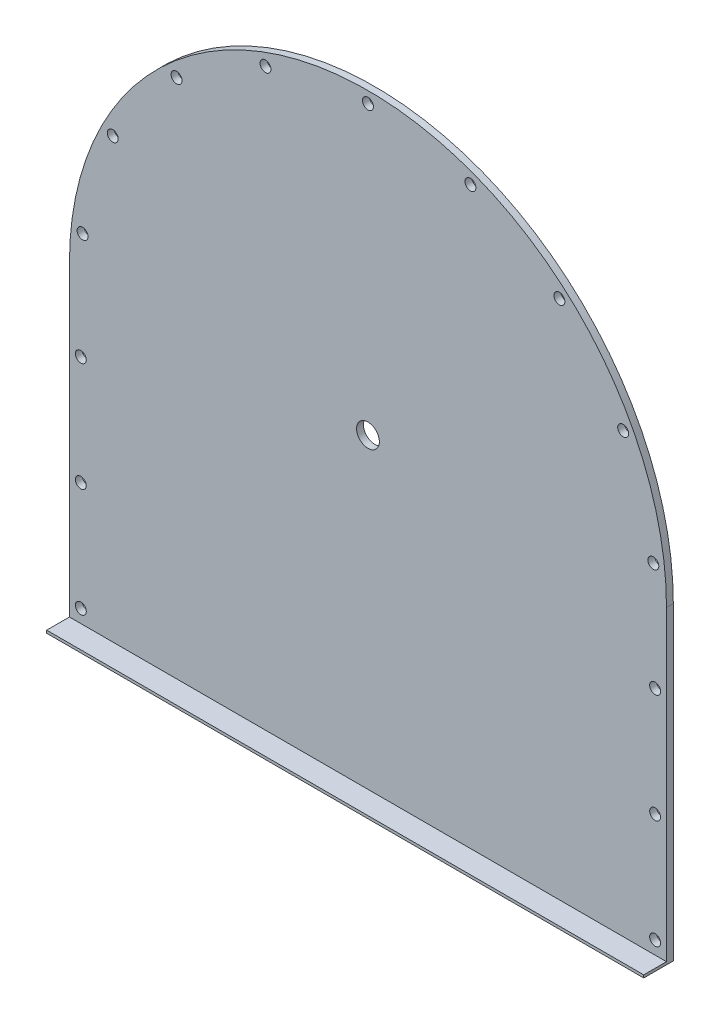
ISO-10303-21;
HEADER;
FILE_DESCRIPTION(('STEP AP214'),'2;1');
FILE_NAME('part.step','',(''),(''),'','','');
FILE_SCHEMA(('AUTOMOTIVE_DESIGN { 1 0 10303 214 1 1 1 1 }'));
ENDSEC;
DATA;
#1=APPLICATION_CONTEXT('core data for automotive mechanical design processes');
#2=APPLICATION_PROTOCOL_DEFINITION('international standard','automotive_design',2000,#1);
#3=PRODUCT_CONTEXT('',#1,'mechanical');
#4=PRODUCT('Part','Part','',(#3));
#5=PRODUCT_RELATED_PRODUCT_CATEGORY('part','',(#4));
#6=PRODUCT_DEFINITION_FORMATION('','',#4);
#7=PRODUCT_DEFINITION_CONTEXT('part definition',#1,'design');
#8=PRODUCT_DEFINITION('design','',#6,#7);
#9=PRODUCT_DEFINITION_SHAPE('','',#8);
#10=(LENGTH_UNIT() NAMED_UNIT(*) SI_UNIT(.MILLI.,.METRE.));
#11=(NAMED_UNIT(*) PLANE_ANGLE_UNIT() SI_UNIT($,.RADIAN.));
#12=(NAMED_UNIT(*) SI_UNIT($,.STERADIAN.) SOLID_ANGLE_UNIT());
#13=UNCERTAINTY_MEASURE_WITH_UNIT(LENGTH_MEASURE(1.E-05),#10,'distance_accuracy_value','');
#14=(GEOMETRIC_REPRESENTATION_CONTEXT(3) GLOBAL_UNCERTAINTY_ASSIGNED_CONTEXT((#13)) GLOBAL_UNIT_ASSIGNED_CONTEXT((#10,
#11,#12)) REPRESENTATION_CONTEXT('',''));
#15=CARTESIAN_POINT('',(0.,0.,0.));
#16=DIRECTION('',(0.,0.,1.));
#17=DIRECTION('',(1.,0.,0.));
#18=AXIS2_PLACEMENT_3D('',#15,#16,#17);
#19=CARTESIAN_POINT('',(0.,680.,15.));
#20=DIRECTION('',(0.,0.,1.));
#21=DIRECTION('',(1.,0.,0.));
#22=AXIS2_PLACEMENT_3D('',#19,#20,#21);
#23=PLANE('',#22);
#24=CARTESIAN_POINT('',(0.,680.,15.));
#25=DIRECTION('',(0.,0.,1.));
#26=DIRECTION('',(1.,0.,0.));
#27=AXIS2_PLACEMENT_3D('',#24,#25,#26);
#28=CIRCLE('',#27,25.);
#29=CARTESIAN_POINT('',(25.,680.,15.));
#30=VERTEX_POINT('',#29);
#31=EDGE_CURVE('E262',#30,#30,#28,.T.);
#32=ORIENTED_EDGE('',*,*,#31,.F.);
#33=EDGE_LOOP('',(#32));
#34=FACE_BOUND('',#33,.T.);
#35=CARTESIAN_POINT('',(-631.,274.348912911065,15.));
#36=DIRECTION('',(0.,0.,1.));
#37=DIRECTION('',(1.,0.,0.));
#38=AXIS2_PLACEMENT_3D('',#35,#36,#37);
#39=CIRCLE('',#38,12.);
#40=CARTESIAN_POINT('',(-619.,274.348912911065,15.));
#41=VERTEX_POINT('',#40);
#42=EDGE_CURVE('E239',#41,#41,#39,.F.);
#43=ORIENTED_EDGE('',*,*,#42,.T.);
#44=EDGE_LOOP('',(#43));
#45=FACE_BOUND('',#44,.T.);
#46=CARTESIAN_POINT('',(-627.092089955321,750.117834503557,15.));
#47=DIRECTION('',(0.,0.,1.));
#48=DIRECTION('',(1.,0.,0.));
#49=AXIS2_PLACEMENT_3D('',#46,#47,#48);
#50=CIRCLE('',#49,12.);
#51=CARTESIAN_POINT('',(-615.092089955321,750.117834503557,15.));
#52=VERTEX_POINT('',#51);
#53=EDGE_CURVE('E245',#52,#52,#50,.F.);
#54=ORIENTED_EDGE('',*,*,#53,.T.);
#55=EDGE_LOOP('',(#54));
#56=FACE_BOUND('',#55,.T.);
#57=CARTESIAN_POINT('',(-420.664145386944,1150.32188635643,15.));
#58=DIRECTION('',(0.,0.,1.));
#59=DIRECTION('',(1.,0.,0.));
#60=AXIS2_PLACEMENT_3D('',#57,#58,#59);
#61=CIRCLE('',#60,12.);
#62=CARTESIAN_POINT('',(-408.664145386944,1150.32188635643,15.));
#63=VERTEX_POINT('',#62);
#64=EDGE_CURVE('E251',#63,#63,#61,.F.);
#65=ORIENTED_EDGE('',*,*,#64,.T.);
#66=EDGE_LOOP('',(#65));
#67=FACE_BOUND('',#66,.T.);
#68=CARTESIAN_POINT('',(631.,35.,15.));
#69=DIRECTION('',(0.,0.,1.));
#70=DIRECTION('',(1.,0.,0.));
#71=AXIS2_PLACEMENT_3D('',#68,#69,#70);
#72=CIRCLE('',#71,12.);
#73=CARTESIAN_POINT('',(643.,35.,15.));
#74=VERTEX_POINT('',#73);
#75=EDGE_CURVE('E174',#74,#74,#72,.T.);
#76=ORIENTED_EDGE('',*,*,#75,.F.);
#77=EDGE_LOOP('',(#76));
#78=FACE_BOUND('',#77,.T.);
#79=CARTESIAN_POINT('',(0.,1311.,15.));
#80=DIRECTION('',(0.,0.,1.));
#81=DIRECTION('',(1.,0.,0.));
#82=AXIS2_PLACEMENT_3D('',#79,#80,#81);
#83=CIRCLE('',#82,12.);
#84=CARTESIAN_POINT('',(12.,1311.,15.));
#85=VERTEX_POINT('',#84);
#86=EDGE_CURVE('E212',#85,#85,#83,.T.);
#87=ORIENTED_EDGE('',*,*,#86,.F.);
#88=EDGE_LOOP('',(#87));
#89=FACE_BOUND('',#88,.T.);
#90=CARTESIAN_POINT('',(225.153158659935,1269.46336200434,15.));
#91=DIRECTION('',(0.,0.,1.));
#92=DIRECTION('',(1.,0.,0.));
#93=AXIS2_PLACEMENT_3D('',#90,#91,#92);
#94=CIRCLE('',#93,12.);
#95=CARTESIAN_POINT('',(237.153158659935,1269.46336200434,15.));
#96=VERTEX_POINT('',#95);
#97=EDGE_CURVE('E209',#96,#96,#94,.T.);
#98=ORIENTED_EDGE('',*,*,#97,.F.);
#99=EDGE_LOOP('',(#98));
#100=FACE_BOUND('',#99,.T.);
#101=CARTESIAN_POINT('',(420.664145386944,1150.32188635643,15.));
#102=DIRECTION('',(0.,0.,1.));
#103=DIRECTION('',(1.,0.,0.));
#104=AXIS2_PLACEMENT_3D('',#101,#102,#103);
#105=CIRCLE('',#104,12.);
#106=CARTESIAN_POINT('',(432.664145386944,1150.32188635643,15.));
#107=VERTEX_POINT('',#106);
#108=EDGE_CURVE('E206',#107,#107,#105,.T.);
#109=ORIENTED_EDGE('',*,*,#108,.F.);
#110=EDGE_LOOP('',(#109));
#111=FACE_BOUND('',#110,.T.);
#112=CARTESIAN_POINT('',(560.793280054704,969.260949741728,15.));
#113=DIRECTION('',(0.,0.,1.));
#114=DIRECTION('',(1.,0.,0.));
#115=AXIS2_PLACEMENT_3D('',#112,#113,#114);
#116=CIRCLE('',#115,12.);
#117=CARTESIAN_POINT('',(572.793280054704,969.260949741728,15.));
#118=VERTEX_POINT('',#117);
#119=EDGE_CURVE('E203',#118,#118,#116,.T.);
#120=ORIENTED_EDGE('',*,*,#119,.F.);
#121=EDGE_LOOP('',(#120));
#122=FACE_BOUND('',#121,.T.);
#123=CARTESIAN_POINT('',(627.092089955321,750.117834503557,15.));
#124=DIRECTION('',(0.,0.,1.));
#125=DIRECTION('',(1.,0.,0.));
#126=AXIS2_PLACEMENT_3D('',#123,#124,#125);
#127=CIRCLE('',#126,12.);
#128=CARTESIAN_POINT('',(639.092089955321,750.117834503557,15.));
#129=VERTEX_POINT('',#128);
#130=EDGE_CURVE('E200',#129,#129,#127,.T.);
#131=ORIENTED_EDGE('',*,*,#130,.F.);
#132=EDGE_LOOP('',(#131));
#133=FACE_BOUND('',#132,.T.);
#134=CARTESIAN_POINT('',(631.,513.697825822129,15.));
#135=DIRECTION('',(0.,0.,1.));
#136=DIRECTION('',(1.,0.,0.));
#137=AXIS2_PLACEMENT_3D('',#134,#135,#136);
#138=CIRCLE('',#137,12.);
#139=CARTESIAN_POINT('',(643.,513.697825822129,15.));
#140=VERTEX_POINT('',#139);
#141=EDGE_CURVE('E197',#140,#140,#138,.T.);
#142=ORIENTED_EDGE('',*,*,#141,.F.);
#143=EDGE_LOOP('',(#142));
#144=FACE_BOUND('',#143,.T.);
#145=CARTESIAN_POINT('',(631.,274.348912911065,15.));
#146=DIRECTION('',(0.,0.,1.));
#147=DIRECTION('',(1.,0.,0.));
#148=AXIS2_PLACEMENT_3D('',#145,#146,#147);
#149=CIRCLE('',#148,12.);
#150=CARTESIAN_POINT('',(643.,274.348912911065,15.));
#151=VERTEX_POINT('',#150);
#152=EDGE_CURVE('E194',#151,#151,#149,.T.);
#153=ORIENTED_EDGE('',*,*,#152,.F.);
#154=EDGE_LOOP('',(#153));
#155=FACE_BOUND('',#154,.T.);
#156=CARTESIAN_POINT('',(-225.153158659935,1269.46336200434,15.));
#157=DIRECTION('',(0.,0.,1.));
#158=DIRECTION('',(1.,0.,0.));
#159=AXIS2_PLACEMENT_3D('',#156,#157,#158);
#160=CIRCLE('',#159,12.);
#161=CARTESIAN_POINT('',(-213.153158659935,1269.46336200434,15.));
#162=VERTEX_POINT('',#161);
#163=EDGE_CURVE('E254',#162,#162,#160,.F.);
#164=ORIENTED_EDGE('',*,*,#163,.T.);
#165=EDGE_LOOP('',(#164));
#166=FACE_BOUND('',#165,.T.);
#167=CARTESIAN_POINT('',(-560.793280054704,969.260949741728,15.));
#168=DIRECTION('',(0.,0.,1.));
#169=DIRECTION('',(1.,0.,0.));
#170=AXIS2_PLACEMENT_3D('',#167,#168,#169);
#171=CIRCLE('',#170,12.);
#172=CARTESIAN_POINT('',(-548.793280054704,969.260949741728,15.));
#173=VERTEX_POINT('',#172);
#174=EDGE_CURVE('E248',#173,#173,#171,.F.);
#175=ORIENTED_EDGE('',*,*,#174,.T.);
#176=EDGE_LOOP('',(#175));
#177=FACE_BOUND('',#176,.T.);
#178=CARTESIAN_POINT('',(-631.,513.697825822129,15.));
#179=DIRECTION('',(0.,0.,1.));
#180=DIRECTION('',(1.,0.,0.));
#181=AXIS2_PLACEMENT_3D('',#178,#179,#180);
#182=CIRCLE('',#181,12.);
#183=CARTESIAN_POINT('',(-619.,513.697825822129,15.));
#184=VERTEX_POINT('',#183);
#185=EDGE_CURVE('E242',#184,#184,#182,.F.);
#186=ORIENTED_EDGE('',*,*,#185,.T.);
#187=EDGE_LOOP('',(#186));
#188=FACE_BOUND('',#187,.T.);
#189=CARTESIAN_POINT('',(-631.,35.,15.));
#190=DIRECTION('',(0.,0.,1.));
#191=DIRECTION('',(1.,0.,0.));
#192=AXIS2_PLACEMENT_3D('',#189,#190,#191);
#193=CIRCLE('',#192,12.);
#194=CARTESIAN_POINT('',(-619.,35.,15.));
#195=VERTEX_POINT('',#194);
#196=EDGE_CURVE('E220',#195,#195,#193,.F.);
#197=ORIENTED_EDGE('',*,*,#196,.T.);
#198=EDGE_LOOP('',(#197));
#199=FACE_BOUND('',#198,.T.);
#200=DIRECTION('',(0.,1.,0.));
#201=VECTOR('',#200,1.);
#202=CARTESIAN_POINT('',(-656.,0.,15.));
#203=LINE('',#202,#201);
#204=CARTESIAN_POINT('',(-656.,6.,15.));
#205=VERTEX_POINT('',#204);
#206=CARTESIAN_POINT('',(-656.,680.,15.));
#207=VERTEX_POINT('',#206);
#208=EDGE_CURVE('E169',#205,#207,#203,.T.);
#209=ORIENTED_EDGE('',*,*,#208,.F.);
#210=DIRECTION('',(1.,0.,0.));
#211=VECTOR('',#210,1.);
#212=CARTESIAN_POINT('',(-656.,6.,15.));
#213=LINE('',#212,#211);
#214=CARTESIAN_POINT('',(656.,6.,15.));
#215=VERTEX_POINT('',#214);
#216=EDGE_CURVE('E289',#205,#215,#213,.T.);
#217=ORIENTED_EDGE('',*,*,#216,.T.);
#218=DIRECTION('',(0.,1.,0.));
#219=VECTOR('',#218,1.);
#220=CARTESIAN_POINT('',(656.,0.,15.));
#221=LINE('',#220,#219);
#222=CARTESIAN_POINT('',(656.,680.,15.));
#223=VERTEX_POINT('',#222);
#224=EDGE_CURVE('E130',#215,#223,#221,.T.);
#225=ORIENTED_EDGE('',*,*,#224,.T.);
#226=CARTESIAN_POINT('',(0.,680.,15.));
#227=DIRECTION('',(0.,0.,1.));
#228=DIRECTION('',(1.,0.,0.));
#229=AXIS2_PLACEMENT_3D('',#226,#227,#228);
#230=CIRCLE('',#229,656.);
#231=EDGE_CURVE('E188',#223,#207,#230,.T.);
#232=ORIENTED_EDGE('',*,*,#231,.T.);
#233=EDGE_LOOP('',(#209,#217,#225,#232));
#234=FACE_BOUND('',#233,.T.);
#235=ADVANCED_FACE('F105',(#34,#45,#56,#67,#78,#89,#100,#111,#122,#133,#144,#155,#166,#177,#188,
#199,#234),#23,.T.);
#236=CARTESIAN_POINT('',(0.,680.,0.));
#237=DIRECTION('',(0.,0.,1.));
#238=DIRECTION('',(1.,0.,0.));
#239=AXIS2_PLACEMENT_3D('',#236,#237,#238);
#240=PLANE('',#239);
#241=CARTESIAN_POINT('',(0.,680.,0.));
#242=DIRECTION('',(0.,0.,1.));
#243=DIRECTION('',(1.,0.,0.));
#244=AXIS2_PLACEMENT_3D('',#241,#242,#243);
#245=CIRCLE('',#244,25.);
#246=CARTESIAN_POINT('',(25.,680.,0.));
#247=VERTEX_POINT('',#246);
#248=EDGE_CURVE('E281',#247,#247,#245,.T.);
#249=ORIENTED_EDGE('',*,*,#248,.T.);
#250=EDGE_LOOP('',(#249));
#251=FACE_BOUND('',#250,.T.);
#252=CARTESIAN_POINT('',(631.,274.348912911065,0.));
#253=DIRECTION('',(0.,0.,1.));
#254=DIRECTION('',(1.,0.,0.));
#255=AXIS2_PLACEMENT_3D('',#252,#253,#254);
#256=CIRCLE('',#255,12.);
#257=CARTESIAN_POINT('',(643.,274.348912911065,0.));
#258=VERTEX_POINT('',#257);
#259=EDGE_CURVE('E215',#258,#258,#256,.T.);
#260=ORIENTED_EDGE('',*,*,#259,.T.);
#261=EDGE_LOOP('',(#260));
#262=FACE_BOUND('',#261,.T.);
#263=CARTESIAN_POINT('',(631.,513.697825822129,0.));
#264=DIRECTION('',(0.,0.,1.));
#265=DIRECTION('',(1.,0.,0.));
#266=AXIS2_PLACEMENT_3D('',#263,#264,#265);
#267=CIRCLE('',#266,12.);
#268=CARTESIAN_POINT('',(643.,513.697825822129,0.));
#269=VERTEX_POINT('',#268);
#270=EDGE_CURVE('E232',#269,#269,#267,.T.);
#271=ORIENTED_EDGE('',*,*,#270,.T.);
#272=EDGE_LOOP('',(#271));
#273=FACE_BOUND('',#272,.T.);
#274=CARTESIAN_POINT('',(627.092089955321,750.117834503557,0.));
#275=DIRECTION('',(0.,0.,1.));
#276=DIRECTION('',(0.993806798661366,0.111121766249679,0.));
#277=AXIS2_PLACEMENT_3D('',#274,#275,#276);
#278=CIRCLE('',#277,12.);
#279=CARTESIAN_POINT('',(639.017771539257,751.451295698553,0.));
#280=VERTEX_POINT('',#279);
#281=EDGE_CURVE('E229',#280,#280,#278,.T.);
#282=ORIENTED_EDGE('',*,*,#281,.T.);
#283=EDGE_LOOP('',(#282));
#284=FACE_BOUND('',#283,.T.);
#285=CARTESIAN_POINT('',(560.793280054704,969.260949741728,0.));
#286=DIRECTION('',(0.,0.,1.));
#287=DIRECTION('',(0.888737369341851,0.458416719083551,0.));
#288=AXIS2_PLACEMENT_3D('',#285,#286,#287);
#289=CIRCLE('',#288,12.);
#290=CARTESIAN_POINT('',(571.458128486806,974.761950370731,0.));
#291=VERTEX_POINT('',#290);
#292=EDGE_CURVE('E226',#291,#291,#289,.T.);
#293=ORIENTED_EDGE('',*,*,#292,.T.);
#294=EDGE_LOOP('',(#293));
#295=FACE_BOUND('',#294,.T.);
#296=CARTESIAN_POINT('',(420.664145386944,1150.32188635643,0.));
#297=DIRECTION('',(0.,0.,1.));
#298=DIRECTION('',(0.666662670977734,0.74535956633348,0.));
#299=AXIS2_PLACEMENT_3D('',#296,#297,#298);
#300=CIRCLE('',#299,12.);
#301=CARTESIAN_POINT('',(428.664097438677,1159.26620115243,0.));
#302=VERTEX_POINT('',#301);
#303=EDGE_CURVE('E223',#302,#302,#300,.T.);
#304=ORIENTED_EDGE('',*,*,#303,.T.);
#305=EDGE_LOOP('',(#304));
#306=FACE_BOUND('',#305,.T.);
#307=CARTESIAN_POINT('',(225.153158659935,1269.46336200434,0.));
#308=DIRECTION('',(0.,0.,1.));
#309=DIRECTION('',(0.356819585831922,0.934173315379291,0.));
#310=AXIS2_PLACEMENT_3D('',#307,#308,#309);
#311=CIRCLE('',#310,12.);
#312=CARTESIAN_POINT('',(229.434993689918,1280.67344178889,0.));
#313=VERTEX_POINT('',#312);
#314=EDGE_CURVE('E219',#313,#313,#311,.T.);
#315=ORIENTED_EDGE('',*,*,#314,.T.);
#316=EDGE_LOOP('',(#315));
#317=FACE_BOUND('',#316,.T.);
#318=CARTESIAN_POINT('',(0.,1311.,0.));
#319=DIRECTION('',(0.,0.,1.));
#320=DIRECTION('',(0.,1.,0.));
#321=AXIS2_PLACEMENT_3D('',#318,#319,#320);
#322=CIRCLE('',#321,12.);
#323=CARTESIAN_POINT('',(1.68325892343959E-13,1323.,0.));
#324=VERTEX_POINT('',#323);
#325=EDGE_CURVE('E216',#324,#324,#322,.T.);
#326=ORIENTED_EDGE('',*,*,#325,.T.);
#327=EDGE_LOOP('',(#326));
#328=FACE_BOUND('',#327,.T.);
#329=CARTESIAN_POINT('',(631.,35.,0.));
#330=DIRECTION('',(0.,0.,1.));
#331=DIRECTION('',(1.,0.,0.));
#332=AXIS2_PLACEMENT_3D('',#329,#330,#331);
#333=CIRCLE('',#332,12.);
#334=CARTESIAN_POINT('',(643.,35.,0.));
#335=VERTEX_POINT('',#334);
#336=EDGE_CURVE('E178',#335,#335,#333,.T.);
#337=ORIENTED_EDGE('',*,*,#336,.T.);
#338=EDGE_LOOP('',(#337));
#339=FACE_BOUND('',#338,.T.);
#340=DIRECTION('',(0.,1.,0.));
#341=VECTOR('',#340,1.);
#342=CARTESIAN_POINT('',(-656.,0.,0.));
#343=LINE('',#342,#341);
#344=CARTESIAN_POINT('',(-656.,0.,0.));
#345=VERTEX_POINT('',#344);
#346=CARTESIAN_POINT('',(-656.,680.,0.));
#347=VERTEX_POINT('',#346);
#348=EDGE_CURVE('E167',#345,#347,#343,.T.);
#349=ORIENTED_EDGE('',*,*,#348,.T.);
#350=CARTESIAN_POINT('',(0.,680.,0.));
#351=DIRECTION('',(0.,0.,1.));
#352=DIRECTION('',(1.,0.,0.));
#353=AXIS2_PLACEMENT_3D('',#350,#351,#352);
#354=CIRCLE('',#353,656.);
#355=CARTESIAN_POINT('',(656.,680.,0.));
#356=VERTEX_POINT('',#355);
#357=EDGE_CURVE('E173',#356,#347,#354,.T.);
#358=ORIENTED_EDGE('',*,*,#357,.F.);
#359=DIRECTION('',(0.,1.,0.));
#360=VECTOR('',#359,1.);
#361=CARTESIAN_POINT('',(656.,0.,0.));
#362=LINE('',#361,#360);
#363=CARTESIAN_POINT('',(656.,0.,0.));
#364=VERTEX_POINT('',#363);
#365=EDGE_CURVE('E168',#364,#356,#362,.T.);
#366=ORIENTED_EDGE('',*,*,#365,.F.);
#367=DIRECTION('',(1.,0.,0.));
#368=VECTOR('',#367,1.);
#369=CARTESIAN_POINT('',(-656.,0.,0.));
#370=LINE('',#369,#368);
#371=EDGE_CURVE('E152',#345,#364,#370,.T.);
#372=ORIENTED_EDGE('',*,*,#371,.F.);
#373=EDGE_LOOP('',(#349,#358,#366,#372));
#374=FACE_BOUND('',#373,.T.);
#375=CARTESIAN_POINT('',(-225.153158659935,1269.46336200434,0.));
#376=DIRECTION('',(0.,0.,-1.));
#377=DIRECTION('',(-0.356819585831922,0.934173315379291,0.));
#378=AXIS2_PLACEMENT_3D('',#375,#376,#377);
#379=CIRCLE('',#378,12.);
#380=CARTESIAN_POINT('',(-229.434993689918,1280.67344178889,0.));
#381=VERTEX_POINT('',#380);
#382=EDGE_CURVE('E258',#381,#381,#379,.T.);
#383=ORIENTED_EDGE('',*,*,#382,.F.);
#384=EDGE_LOOP('',(#383));
#385=FACE_BOUND('',#384,.T.);
#386=CARTESIAN_POINT('',(-420.664145386944,1150.32188635643,0.));
#387=DIRECTION('',(0.,0.,-1.));
#388=DIRECTION('',(-0.666662670977734,0.74535956633348,0.));
#389=AXIS2_PLACEMENT_3D('',#386,#387,#388);
#390=CIRCLE('',#389,12.);
#391=CARTESIAN_POINT('',(-428.664097438677,1159.26620115243,0.));
#392=VERTEX_POINT('',#391);
#393=EDGE_CURVE('E261',#392,#392,#390,.T.);
#394=ORIENTED_EDGE('',*,*,#393,.F.);
#395=EDGE_LOOP('',(#394));
#396=FACE_BOUND('',#395,.T.);
#397=CARTESIAN_POINT('',(-560.793280054704,969.260949741728,0.));
#398=DIRECTION('',(0.,0.,-1.));
#399=DIRECTION('',(-0.888737369341851,0.458416719083551,0.));
#400=AXIS2_PLACEMENT_3D('',#397,#398,#399);
#401=CIRCLE('',#400,12.);
#402=CARTESIAN_POINT('',(-571.458128486806,974.761950370731,0.));
#403=VERTEX_POINT('',#402);
#404=EDGE_CURVE('E265',#403,#403,#401,.T.);
#405=ORIENTED_EDGE('',*,*,#404,.F.);
#406=EDGE_LOOP('',(#405));
#407=FACE_BOUND('',#406,.T.);
#408=CARTESIAN_POINT('',(-627.092089955321,750.117834503557,0.));
#409=DIRECTION('',(0.,0.,-1.));
#410=DIRECTION('',(-0.993806798661366,0.111121766249679,0.));
#411=AXIS2_PLACEMENT_3D('',#408,#409,#410);
#412=CIRCLE('',#411,12.);
#413=CARTESIAN_POINT('',(-639.017771539257,751.451295698553,0.));
#414=VERTEX_POINT('',#413);
#415=EDGE_CURVE('E268',#414,#414,#412,.T.);
#416=ORIENTED_EDGE('',*,*,#415,.F.);
#417=EDGE_LOOP('',(#416));
#418=FACE_BOUND('',#417,.T.);
#419=CARTESIAN_POINT('',(-631.,513.697825822129,0.));
#420=DIRECTION('',(0.,0.,-1.));
#421=DIRECTION('',(-1.,0.,0.));
#422=AXIS2_PLACEMENT_3D('',#419,#420,#421);
#423=CIRCLE('',#422,12.);
#424=CARTESIAN_POINT('',(-643.,513.697825822129,0.));
#425=VERTEX_POINT('',#424);
#426=EDGE_CURVE('E271',#425,#425,#423,.T.);
#427=ORIENTED_EDGE('',*,*,#426,.F.);
#428=EDGE_LOOP('',(#427));
#429=FACE_BOUND('',#428,.T.);
#430=CARTESIAN_POINT('',(-631.,274.348912911065,0.));
#431=DIRECTION('',(0.,0.,-1.));
#432=DIRECTION('',(-1.,0.,0.));
#433=AXIS2_PLACEMENT_3D('',#430,#431,#432);
#434=CIRCLE('',#433,12.);
#435=CARTESIAN_POINT('',(-643.,274.348912911065,0.));
#436=VERTEX_POINT('',#435);
#437=EDGE_CURVE('E274',#436,#436,#434,.T.);
#438=ORIENTED_EDGE('',*,*,#437,.F.);
#439=EDGE_LOOP('',(#438));
#440=FACE_BOUND('',#439,.T.);
#441=CARTESIAN_POINT('',(-631.,35.,0.));
#442=DIRECTION('',(0.,0.,-1.));
#443=DIRECTION('',(-1.,0.,0.));
#444=AXIS2_PLACEMENT_3D('',#441,#442,#443);
#445=CIRCLE('',#444,12.);
#446=CARTESIAN_POINT('',(-643.,35.,0.));
#447=VERTEX_POINT('',#446);
#448=EDGE_CURVE('E257',#447,#447,#445,.T.);
#449=ORIENTED_EDGE('',*,*,#448,.F.);
#450=EDGE_LOOP('',(#449));
#451=FACE_BOUND('',#450,.T.);
#452=ADVANCED_FACE('F164',(#251,#262,#273,#284,#295,#306,#317,#328,#339,#374,#385,#396,#407,
#418,#429,#440,#451),#240,.F.);
#453=CARTESIAN_POINT('',(-656.,0.,15.));
#454=DIRECTION('',(-1.,0.,0.));
#455=DIRECTION('',(0.,0.,1.));
#456=AXIS2_PLACEMENT_3D('',#453,#454,#455);
#457=PLANE('',#456);
#458=ORIENTED_EDGE('',*,*,#348,.F.);
#459=DIRECTION('',(0.,0.,-1.));
#460=VECTOR('',#459,1.);
#461=CARTESIAN_POINT('',(-656.,0.,15.));
#462=LINE('',#461,#460);
#463=CARTESIAN_POINT('',(-656.,0.,65.));
#464=VERTEX_POINT('',#463);
#465=EDGE_CURVE('E13',#464,#345,#462,.T.);
#466=ORIENTED_EDGE('',*,*,#465,.F.);
#467=DIRECTION('',(0.,-1.,0.));
#468=VECTOR('',#467,1.);
#469=CARTESIAN_POINT('',(-656.,6.,65.));
#470=LINE('',#469,#468);
#471=CARTESIAN_POINT('',(-656.,6.,65.));
#472=VERTEX_POINT('',#471);
#473=EDGE_CURVE('E291',#472,#464,#470,.T.);
#474=ORIENTED_EDGE('',*,*,#473,.F.);
#475=DIRECTION('',(0.,0.,-1.));
#476=VECTOR('',#475,1.);
#477=CARTESIAN_POINT('',(-656.,6.,65.));
#478=LINE('',#477,#476);
#479=EDGE_CURVE('E285',#472,#205,#478,.T.);
#480=ORIENTED_EDGE('',*,*,#479,.T.);
#481=ORIENTED_EDGE('',*,*,#208,.T.);
#482=DIRECTION('',(0.,0.,-1.));
#483=VECTOR('',#482,1.);
#484=CARTESIAN_POINT('',(-656.,680.,15.));
#485=LINE('',#484,#483);
#486=EDGE_CURVE('E109',#207,#347,#485,.T.);
#487=ORIENTED_EDGE('',*,*,#486,.T.);
#488=EDGE_LOOP('',(#458,#466,#474,#480,#481,#487));
#489=FACE_BOUND('',#488,.T.);
#490=ADVANCED_FACE('F107',(#489),#457,.T.);
#491=CARTESIAN_POINT('',(-656.,0.,15.));
#492=DIRECTION('',(0.,1.,0.));
#493=DIRECTION('',(0.,0.,1.));
#494=AXIS2_PLACEMENT_3D('',#491,#492,#493);
#495=PLANE('',#494);
#496=ORIENTED_EDGE('',*,*,#371,.T.);
#497=DIRECTION('',(0.,0.,-1.));
#498=VECTOR('',#497,1.);
#499=CARTESIAN_POINT('',(656.,0.,15.));
#500=LINE('',#499,#498);
#501=CARTESIAN_POINT('',(656.,0.,65.));
#502=VERTEX_POINT('',#501);
#503=EDGE_CURVE('E114',#502,#364,#500,.T.);
#504=ORIENTED_EDGE('',*,*,#503,.F.);
#505=DIRECTION('',(1.,0.,0.));
#506=VECTOR('',#505,1.);
#507=CARTESIAN_POINT('',(-656.,0.,65.));
#508=LINE('',#507,#506);
#509=EDGE_CURVE('E156',#464,#502,#508,.T.);
#510=ORIENTED_EDGE('',*,*,#509,.F.);
#511=ORIENTED_EDGE('',*,*,#465,.T.);
#512=EDGE_LOOP('',(#496,#504,#510,#511));
#513=FACE_BOUND('',#512,.T.);
#514=ADVANCED_FACE('F150',(#513),#495,.F.);
#515=CARTESIAN_POINT('',(656.,0.,15.));
#516=DIRECTION('',(-1.,0.,0.));
#517=DIRECTION('',(0.,0.,1.));
#518=AXIS2_PLACEMENT_3D('',#515,#516,#517);
#519=PLANE('',#518);
#520=ORIENTED_EDGE('',*,*,#365,.T.);
#521=DIRECTION('',(0.,0.,-1.));
#522=VECTOR('',#521,1.);
#523=CARTESIAN_POINT('',(656.,680.,15.));
#524=LINE('',#523,#522);
#525=EDGE_CURVE('E184',#223,#356,#524,.T.);
#526=ORIENTED_EDGE('',*,*,#525,.F.);
#527=ORIENTED_EDGE('',*,*,#224,.F.);
#528=DIRECTION('',(0.,0.,-1.));
#529=VECTOR('',#528,1.);
#530=CARTESIAN_POINT('',(656.,6.,65.));
#531=LINE('',#530,#529);
#532=CARTESIAN_POINT('',(656.,6.,65.));
#533=VERTEX_POINT('',#532);
#534=EDGE_CURVE('E122',#533,#215,#531,.T.);
#535=ORIENTED_EDGE('',*,*,#534,.F.);
#536=DIRECTION('',(0.,1.,0.));
#537=VECTOR('',#536,1.);
#538=CARTESIAN_POINT('',(656.,0.,65.));
#539=LINE('',#538,#537);
#540=EDGE_CURVE('E293',#502,#533,#539,.T.);
#541=ORIENTED_EDGE('',*,*,#540,.F.);
#542=ORIENTED_EDGE('',*,*,#503,.T.);
#543=EDGE_LOOP('',(#520,#526,#527,#535,#541,#542));
#544=FACE_BOUND('',#543,.T.);
#545=ADVANCED_FACE('F310',(#544),#519,.F.);
#546=CARTESIAN_POINT('',(0.,680.,15.));
#547=DIRECTION('',(0.,0.,-1.));
#548=DIRECTION('',(-1.,0.,0.));
#549=AXIS2_PLACEMENT_3D('',#546,#547,#548);
#550=CYLINDRICAL_SURFACE('',#549,656.);
#551=ORIENTED_EDGE('',*,*,#357,.T.);
#552=ORIENTED_EDGE('',*,*,#486,.F.);
#553=ORIENTED_EDGE('',*,*,#231,.F.);
#554=ORIENTED_EDGE('',*,*,#525,.T.);
#555=EDGE_LOOP('',(#551,#552,#553,#554));
#556=FACE_BOUND('',#555,.T.);
#557=ADVANCED_FACE('F341',(#556),#550,.T.);
#558=CARTESIAN_POINT('',(631.,35.,0.));
#559=DIRECTION('',(0.,0.,1.));
#560=DIRECTION('',(1.,0.,0.));
#561=AXIS2_PLACEMENT_3D('',#558,#559,#560);
#562=CYLINDRICAL_SURFACE('',#561,12.);
#563=ORIENTED_EDGE('',*,*,#75,.T.);
#564=EDGE_LOOP('',(#563));
#565=FACE_BOUND('',#564,.T.);
#566=ORIENTED_EDGE('',*,*,#336,.F.);
#567=EDGE_LOOP('',(#566));
#568=FACE_BOUND('',#567,.T.);
#569=ADVANCED_FACE('F336',(#565,#568),#562,.F.);
#570=CARTESIAN_POINT('',(0.,1311.,0.));
#571=DIRECTION('',(0.,0.,1.));
#572=DIRECTION('',(1.,0.,0.));
#573=AXIS2_PLACEMENT_3D('',#570,#571,#572);
#574=CYLINDRICAL_SURFACE('',#573,12.);
#575=ORIENTED_EDGE('',*,*,#86,.T.);
#576=EDGE_LOOP('',(#575));
#577=FACE_BOUND('',#576,.T.);
#578=ORIENTED_EDGE('',*,*,#325,.F.);
#579=EDGE_LOOP('',(#578));
#580=FACE_BOUND('',#579,.T.);
#581=ADVANCED_FACE('F346',(#577,#580),#574,.F.);
#582=CARTESIAN_POINT('',(225.153158659935,1269.46336200434,0.));
#583=DIRECTION('',(0.,0.,1.));
#584=DIRECTION('',(1.,0.,0.));
#585=AXIS2_PLACEMENT_3D('',#582,#583,#584);
#586=CYLINDRICAL_SURFACE('',#585,12.);
#587=ORIENTED_EDGE('',*,*,#97,.T.);
#588=EDGE_LOOP('',(#587));
#589=FACE_BOUND('',#588,.T.);
#590=ORIENTED_EDGE('',*,*,#314,.F.);
#591=EDGE_LOOP('',(#590));
#592=FACE_BOUND('',#591,.T.);
#593=ADVANCED_FACE('F351',(#589,#592),#586,.F.);
#594=CARTESIAN_POINT('',(420.664145386944,1150.32188635643,0.));
#595=DIRECTION('',(0.,0.,1.));
#596=DIRECTION('',(1.,0.,0.));
#597=AXIS2_PLACEMENT_3D('',#594,#595,#596);
#598=CYLINDRICAL_SURFACE('',#597,12.);
#599=ORIENTED_EDGE('',*,*,#108,.T.);
#600=EDGE_LOOP('',(#599));
#601=FACE_BOUND('',#600,.T.);
#602=ORIENTED_EDGE('',*,*,#303,.F.);
#603=EDGE_LOOP('',(#602));
#604=FACE_BOUND('',#603,.T.);
#605=ADVANCED_FACE('F428',(#601,#604),#598,.F.);
#606=CARTESIAN_POINT('',(560.793280054704,969.260949741728,0.));
#607=DIRECTION('',(0.,0.,1.));
#608=DIRECTION('',(1.,0.,0.));
#609=AXIS2_PLACEMENT_3D('',#606,#607,#608);
#610=CYLINDRICAL_SURFACE('',#609,12.);
#611=ORIENTED_EDGE('',*,*,#119,.T.);
#612=EDGE_LOOP('',(#611));
#613=FACE_BOUND('',#612,.T.);
#614=ORIENTED_EDGE('',*,*,#292,.F.);
#615=EDGE_LOOP('',(#614));
#616=FACE_BOUND('',#615,.T.);
#617=ADVANCED_FACE('F424',(#613,#616),#610,.F.);
#618=CARTESIAN_POINT('',(627.092089955321,750.117834503557,0.));
#619=DIRECTION('',(0.,0.,1.));
#620=DIRECTION('',(1.,0.,0.));
#621=AXIS2_PLACEMENT_3D('',#618,#619,#620);
#622=CYLINDRICAL_SURFACE('',#621,12.);
#623=ORIENTED_EDGE('',*,*,#130,.T.);
#624=EDGE_LOOP('',(#623));
#625=FACE_BOUND('',#624,.T.);
#626=ORIENTED_EDGE('',*,*,#281,.F.);
#627=EDGE_LOOP('',(#626));
#628=FACE_BOUND('',#627,.T.);
#629=ADVANCED_FACE('F420',(#625,#628),#622,.F.);
#630=CARTESIAN_POINT('',(631.,513.697825822129,0.));
#631=DIRECTION('',(0.,0.,1.));
#632=DIRECTION('',(1.,0.,0.));
#633=AXIS2_PLACEMENT_3D('',#630,#631,#632);
#634=CYLINDRICAL_SURFACE('',#633,12.);
#635=ORIENTED_EDGE('',*,*,#141,.T.);
#636=EDGE_LOOP('',(#635));
#637=FACE_BOUND('',#636,.T.);
#638=ORIENTED_EDGE('',*,*,#270,.F.);
#639=EDGE_LOOP('',(#638));
#640=FACE_BOUND('',#639,.T.);
#641=ADVANCED_FACE('F416',(#637,#640),#634,.F.);
#642=CARTESIAN_POINT('',(631.,274.348912911065,0.));
#643=DIRECTION('',(0.,0.,1.));
#644=DIRECTION('',(1.,0.,0.));
#645=AXIS2_PLACEMENT_3D('',#642,#643,#644);
#646=CYLINDRICAL_SURFACE('',#645,12.);
#647=ORIENTED_EDGE('',*,*,#152,.T.);
#648=EDGE_LOOP('',(#647));
#649=FACE_BOUND('',#648,.T.);
#650=ORIENTED_EDGE('',*,*,#259,.F.);
#651=EDGE_LOOP('',(#650));
#652=FACE_BOUND('',#651,.T.);
#653=ADVANCED_FACE('F412',(#649,#652),#646,.F.);
#654=CARTESIAN_POINT('',(-225.153158659935,1269.46336200434,0.));
#655=DIRECTION('',(0.,0.,1.));
#656=DIRECTION('',(1.,0.,0.));
#657=AXIS2_PLACEMENT_3D('',#654,#655,#656);
#658=CYLINDRICAL_SURFACE('',#657,12.);
#659=ORIENTED_EDGE('',*,*,#163,.F.);
#660=EDGE_LOOP('',(#659));
#661=FACE_BOUND('',#660,.T.);
#662=ORIENTED_EDGE('',*,*,#382,.T.);
#663=EDGE_LOOP('',(#662));
#664=FACE_BOUND('',#663,.T.);
#665=ADVANCED_FACE('F408',(#661,#664),#658,.F.);
#666=CARTESIAN_POINT('',(-420.664145386944,1150.32188635643,0.));
#667=DIRECTION('',(0.,0.,1.));
#668=DIRECTION('',(1.,0.,0.));
#669=AXIS2_PLACEMENT_3D('',#666,#667,#668);
#670=CYLINDRICAL_SURFACE('',#669,12.);
#671=ORIENTED_EDGE('',*,*,#64,.F.);
#672=EDGE_LOOP('',(#671));
#673=FACE_BOUND('',#672,.T.);
#674=ORIENTED_EDGE('',*,*,#393,.T.);
#675=EDGE_LOOP('',(#674));
#676=FACE_BOUND('',#675,.T.);
#677=ADVANCED_FACE('F404',(#673,#676),#670,.F.);
#678=CARTESIAN_POINT('',(-560.793280054704,969.260949741728,0.));
#679=DIRECTION('',(0.,0.,1.));
#680=DIRECTION('',(1.,0.,0.));
#681=AXIS2_PLACEMENT_3D('',#678,#679,#680);
#682=CYLINDRICAL_SURFACE('',#681,12.);
#683=ORIENTED_EDGE('',*,*,#174,.F.);
#684=EDGE_LOOP('',(#683));
#685=FACE_BOUND('',#684,.T.);
#686=ORIENTED_EDGE('',*,*,#404,.T.);
#687=EDGE_LOOP('',(#686));
#688=FACE_BOUND('',#687,.T.);
#689=ADVANCED_FACE('F400',(#685,#688),#682,.F.);
#690=CARTESIAN_POINT('',(-627.092089955321,750.117834503557,0.));
#691=DIRECTION('',(0.,0.,1.));
#692=DIRECTION('',(1.,0.,0.));
#693=AXIS2_PLACEMENT_3D('',#690,#691,#692);
#694=CYLINDRICAL_SURFACE('',#693,12.);
#695=ORIENTED_EDGE('',*,*,#53,.F.);
#696=EDGE_LOOP('',(#695));
#697=FACE_BOUND('',#696,.T.);
#698=ORIENTED_EDGE('',*,*,#415,.T.);
#699=EDGE_LOOP('',(#698));
#700=FACE_BOUND('',#699,.T.);
#701=ADVANCED_FACE('F396',(#697,#700),#694,.F.);
#702=CARTESIAN_POINT('',(-631.,513.697825822129,0.));
#703=DIRECTION('',(0.,0.,1.));
#704=DIRECTION('',(1.,0.,0.));
#705=AXIS2_PLACEMENT_3D('',#702,#703,#704);
#706=CYLINDRICAL_SURFACE('',#705,12.);
#707=ORIENTED_EDGE('',*,*,#185,.F.);
#708=EDGE_LOOP('',(#707));
#709=FACE_BOUND('',#708,.T.);
#710=ORIENTED_EDGE('',*,*,#426,.T.);
#711=EDGE_LOOP('',(#710));
#712=FACE_BOUND('',#711,.T.);
#713=ADVANCED_FACE('F390',(#709,#712),#706,.F.);
#714=CARTESIAN_POINT('',(-631.,274.348912911065,0.));
#715=DIRECTION('',(0.,0.,1.));
#716=DIRECTION('',(1.,0.,0.));
#717=AXIS2_PLACEMENT_3D('',#714,#715,#716);
#718=CYLINDRICAL_SURFACE('',#717,12.);
#719=ORIENTED_EDGE('',*,*,#42,.F.);
#720=EDGE_LOOP('',(#719));
#721=FACE_BOUND('',#720,.T.);
#722=ORIENTED_EDGE('',*,*,#437,.T.);
#723=EDGE_LOOP('',(#722));
#724=FACE_BOUND('',#723,.T.);
#725=ADVANCED_FACE('F383',(#721,#724),#718,.F.);
#726=CARTESIAN_POINT('',(-631.,35.,0.));
#727=DIRECTION('',(0.,0.,1.));
#728=DIRECTION('',(1.,0.,0.));
#729=AXIS2_PLACEMENT_3D('',#726,#727,#728);
#730=CYLINDRICAL_SURFACE('',#729,12.);
#731=ORIENTED_EDGE('',*,*,#196,.F.);
#732=EDGE_LOOP('',(#731));
#733=FACE_BOUND('',#732,.T.);
#734=ORIENTED_EDGE('',*,*,#448,.T.);
#735=EDGE_LOOP('',(#734));
#736=FACE_BOUND('',#735,.T.);
#737=ADVANCED_FACE('F321',(#733,#736),#730,.F.);
#738=CARTESIAN_POINT('',(0.,680.,0.));
#739=DIRECTION('',(0.,0.,1.));
#740=DIRECTION('',(1.,0.,0.));
#741=AXIS2_PLACEMENT_3D('',#738,#739,#740);
#742=CYLINDRICAL_SURFACE('',#741,25.);
#743=ORIENTED_EDGE('',*,*,#31,.T.);
#744=EDGE_LOOP('',(#743));
#745=FACE_BOUND('',#744,.T.);
#746=ORIENTED_EDGE('',*,*,#248,.F.);
#747=EDGE_LOOP('',(#746));
#748=FACE_BOUND('',#747,.T.);
#749=ADVANCED_FACE('F313',(#745,#748),#742,.F.);
#750=CARTESIAN_POINT('',(-656.,6.,65.));
#751=DIRECTION('',(0.,1.,0.));
#752=DIRECTION('',(0.,0.,1.));
#753=AXIS2_PLACEMENT_3D('',#750,#751,#752);
#754=PLANE('',#753);
#755=ORIENTED_EDGE('',*,*,#216,.F.);
#756=ORIENTED_EDGE('',*,*,#479,.F.);
#757=DIRECTION('',(1.,0.,0.));
#758=VECTOR('',#757,1.);
#759=CARTESIAN_POINT('',(-656.,6.,65.));
#760=LINE('',#759,#758);
#761=EDGE_CURVE('E288',#472,#533,#760,.T.);
#762=ORIENTED_EDGE('',*,*,#761,.T.);
#763=ORIENTED_EDGE('',*,*,#534,.T.);
#764=EDGE_LOOP('',(#755,#756,#762,#763));
#765=FACE_BOUND('',#764,.T.);
#766=ADVANCED_FACE('F311',(#765),#754,.T.);
#767=CARTESIAN_POINT('',(0.,0.,65.));
#768=DIRECTION('',(0.,0.,1.));
#769=DIRECTION('',(1.,0.,0.));
#770=AXIS2_PLACEMENT_3D('',#767,#768,#769);
#771=PLANE('',#770);
#772=ORIENTED_EDGE('',*,*,#473,.T.);
#773=ORIENTED_EDGE('',*,*,#509,.T.);
#774=ORIENTED_EDGE('',*,*,#540,.T.);
#775=ORIENTED_EDGE('',*,*,#761,.F.);
#776=EDGE_LOOP('',(#772,#773,#774,#775));
#777=FACE_BOUND('',#776,.T.);
#778=ADVANCED_FACE('F299',(#777),#771,.T.);
#779=CLOSED_SHELL('',(#235,#452,#490,#514,#545,#557,#569,#581,#593,#605,#617,#629,#641,#653,
#665,#677,#689,#701,#713,#725,#737,#749,#766,#778));
#780=MANIFOLD_SOLID_BREP('B2',#779);
#781=ADVANCED_BREP_SHAPE_REPRESENTATION('',(#18,#780),#14);
#782=SHAPE_DEFINITION_REPRESENTATION(#9,#781);
ENDSEC;
END-ISO-10303-21;
